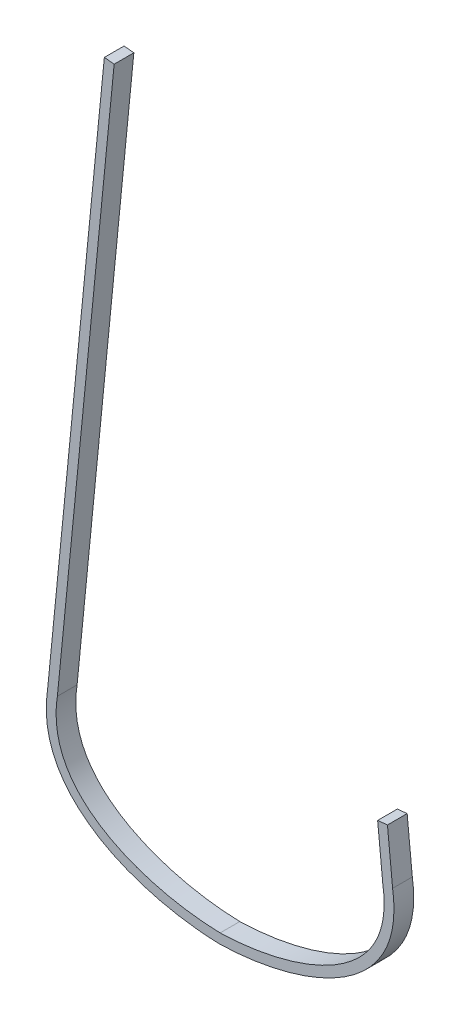
ISO-10303-21;
HEADER;
FILE_DESCRIPTION(('STEP AP214'),'2;1');
FILE_NAME('part.step','',(''),(''),'','','');
FILE_SCHEMA(('AUTOMOTIVE_DESIGN { 1 0 10303 214 1 1 1 1 }'));
ENDSEC;
DATA;
#1=APPLICATION_CONTEXT('core data for automotive mechanical design processes');
#2=APPLICATION_PROTOCOL_DEFINITION('international standard','automotive_design',2000,#1);
#3=PRODUCT_CONTEXT('',#1,'mechanical');
#4=PRODUCT('Part','Part','',(#3));
#5=PRODUCT_RELATED_PRODUCT_CATEGORY('part','',(#4));
#6=PRODUCT_DEFINITION_FORMATION('','',#4);
#7=PRODUCT_DEFINITION_CONTEXT('part definition',#1,'design');
#8=PRODUCT_DEFINITION('design','',#6,#7);
#9=PRODUCT_DEFINITION_SHAPE('','',#8);
#10=(LENGTH_UNIT() NAMED_UNIT(*) SI_UNIT(.MILLI.,.METRE.));
#11=(NAMED_UNIT(*) PLANE_ANGLE_UNIT() SI_UNIT($,.RADIAN.));
#12=(NAMED_UNIT(*) SI_UNIT($,.STERADIAN.) SOLID_ANGLE_UNIT());
#13=UNCERTAINTY_MEASURE_WITH_UNIT(LENGTH_MEASURE(1.E-05),#10,'distance_accuracy_value','');
#14=(GEOMETRIC_REPRESENTATION_CONTEXT(3) GLOBAL_UNCERTAINTY_ASSIGNED_CONTEXT((#13)) GLOBAL_UNIT_ASSIGNED_CONTEXT((#10,
#11,#12)) REPRESENTATION_CONTEXT('',''));
#15=CARTESIAN_POINT('',(0.,0.,0.));
#16=DIRECTION('',(0.,0.,1.));
#17=DIRECTION('',(1.,0.,0.));
#18=AXIS2_PLACEMENT_3D('',#15,#16,#17);
#19=CARTESIAN_POINT('',(0.,0.,19.05));
#20=CARTESIAN_POINT('',(73.6665806217367,1.74067599176395,19.05));
#21=CARTESIAN_POINT('',(181.188092360691,36.2008356091117,19.05));
#22=CARTESIAN_POINT('',(166.6875,130.175,19.05));
#23=B_SPLINE_CURVE_WITH_KNOTS('',3,(#19,#20,#21,#22),.UNSPECIFIED.,.F.,.F.,(4,4),(0.,1.),.UNSPECIFIED.);
#24=DIRECTION('',(0.,0.,-1.));
#25=VECTOR('',#24,1.);
#26=SURFACE_OF_LINEAR_EXTRUSION('',#23,#25);
#27=CARTESIAN_POINT('',(0.,0.,0.));
#28=CARTESIAN_POINT('',(73.6665806217367,1.74067599176395,0.));
#29=CARTESIAN_POINT('',(181.188092360691,36.2008356091117,0.));
#30=CARTESIAN_POINT('',(166.6875,130.175,0.));
#31=B_SPLINE_CURVE_WITH_KNOTS('',3,(#27,#28,#29,#30),.UNSPECIFIED.,.F.,.F.,(4,4),(0.,1.),.UNSPECIFIED.);
#32=CARTESIAN_POINT('',(0.,0.,0.));
#33=VERTEX_POINT('',#32);
#34=CARTESIAN_POINT('',(166.6875,130.175,0.));
#35=VERTEX_POINT('',#34);
#36=EDGE_CURVE('E145',#33,#35,#31,.T.);
#37=ORIENTED_EDGE('',*,*,#36,.T.);
#38=DIRECTION('',(0.,0.,-1.));
#39=VECTOR('',#38,1.);
#40=CARTESIAN_POINT('',(166.6875,130.175,19.05));
#41=LINE('',#40,#39);
#42=CARTESIAN_POINT('',(166.6875,130.175,19.05));
#43=VERTEX_POINT('',#42);
#44=EDGE_CURVE('E11',#43,#35,#41,.T.);
#45=ORIENTED_EDGE('',*,*,#44,.F.);
#46=CARTESIAN_POINT('',(0.,0.,19.05));
#47=VERTEX_POINT('',#46);
#48=EDGE_CURVE('E194',#47,#43,#23,.T.);
#49=ORIENTED_EDGE('',*,*,#48,.F.);
#50=DIRECTION('',(0.,0.,-1.));
#51=VECTOR('',#50,1.);
#52=CARTESIAN_POINT('',(0.,0.,19.05));
#53=LINE('',#52,#51);
#54=EDGE_CURVE('E138',#47,#33,#53,.T.);
#55=ORIENTED_EDGE('',*,*,#54,.T.);
#56=EDGE_LOOP('',(#37,#45,#49,#55));
#57=FACE_BOUND('',#56,.T.);
#58=ADVANCED_FACE('F33',(#57),#26,.F.);
#59=CARTESIAN_POINT('',(166.6875,130.175,19.05));
#60=DIRECTION('',(-0.995175000159784,-0.0981158450861751,0.));
#61=DIRECTION('',(0.0981158450861752,-0.995175000159784,0.));
#62=AXIS2_PLACEMENT_3D('',#59,#60,#61);
#63=PLANE('',#62);
#64=DIRECTION('',(-0.0981158450861751,0.995175000159784,0.));
#65=VECTOR('',#64,1.);
#66=CARTESIAN_POINT('',(166.6875,130.175,0.));
#67=LINE('',#66,#65);
#68=CARTESIAN_POINT('',(161.703215069622,180.729890008117,0.));
#69=VERTEX_POINT('',#68);
#70=EDGE_CURVE('E236',#35,#69,#67,.T.);
#71=ORIENTED_EDGE('',*,*,#70,.T.);
#72=DIRECTION('',(0.,0.,-1.));
#73=VECTOR('',#72,1.);
#74=CARTESIAN_POINT('',(161.703215069622,180.729890008117,19.05));
#75=LINE('',#74,#73);
#76=CARTESIAN_POINT('',(161.703215069622,180.729890008117,19.05));
#77=VERTEX_POINT('',#76);
#78=EDGE_CURVE('E42',#77,#69,#75,.T.);
#79=ORIENTED_EDGE('',*,*,#78,.F.);
#80=DIRECTION('',(-0.0981158450861751,0.995175000159784,0.));
#81=VECTOR('',#80,1.);
#82=CARTESIAN_POINT('',(166.6875,130.175,19.05));
#83=LINE('',#82,#81);
#84=EDGE_CURVE('E99',#43,#77,#83,.T.);
#85=ORIENTED_EDGE('',*,*,#84,.F.);
#86=ORIENTED_EDGE('',*,*,#44,.T.);
#87=EDGE_LOOP('',(#71,#79,#85,#86));
#88=FACE_BOUND('',#87,.T.);
#89=ADVANCED_FACE('F262',(#88),#63,.F.);
#90=CARTESIAN_POINT('',(152.2241731931,179.795336583671,19.05));
#91=DIRECTION('',(0.0981158450861748,-0.995175000159784,0.));
#92=DIRECTION('',(0.995175000159784,0.0981158450861748,0.));
#93=AXIS2_PLACEMENT_3D('',#90,#91,#92);
#94=PLANE('',#93);
#95=DIRECTION('',(-0.995175000159784,-0.0981158450861748,0.));
#96=VECTOR('',#95,1.);
#97=CARTESIAN_POINT('',(152.2241731931,179.795336583671,0.));
#98=LINE('',#97,#96);
#99=CARTESIAN_POINT('',(152.2241731931,179.795336583671,0.));
#100=VERTEX_POINT('',#99);
#101=EDGE_CURVE('E232',#69,#100,#98,.T.);
#102=ORIENTED_EDGE('',*,*,#101,.T.);
#103=DIRECTION('',(0.,0.,-1.));
#104=VECTOR('',#103,1.);
#105=CARTESIAN_POINT('',(152.2241731931,179.795336583671,19.05));
#106=LINE('',#105,#104);
#107=CARTESIAN_POINT('',(152.2241731931,179.795336583671,19.05));
#108=VERTEX_POINT('',#107);
#109=EDGE_CURVE('E224',#108,#100,#106,.T.);
#110=ORIENTED_EDGE('',*,*,#109,.F.);
#111=DIRECTION('',(-0.995175000159784,-0.0981158450861748,0.));
#112=VECTOR('',#111,1.);
#113=CARTESIAN_POINT('',(152.2241731931,179.795336583671,19.05));
#114=LINE('',#113,#112);
#115=EDGE_CURVE('E192',#77,#108,#114,.T.);
#116=ORIENTED_EDGE('',*,*,#115,.F.);
#117=ORIENTED_EDGE('',*,*,#78,.T.);
#118=EDGE_LOOP('',(#102,#110,#116,#117));
#119=FACE_BOUND('',#118,.T.);
#120=ADVANCED_FACE('F230',(#119),#94,.F.);
#121=CARTESIAN_POINT('',(157.23408188197,128.980548453709,19.05));
#122=DIRECTION('',(0.995175000159784,0.0981158450861752,0.));
#123=DIRECTION('',(-0.0981158450861752,0.995175000159784,0.));
#124=AXIS2_PLACEMENT_3D('',#121,#122,#123);
#125=PLANE('',#124);
#126=DIRECTION('',(0.0981158450861752,-0.995175000159784,0.));
#127=VECTOR('',#126,1.);
#128=CARTESIAN_POINT('',(157.23408188197,128.980548453709,0.));
#129=LINE('',#128,#127);
#130=CARTESIAN_POINT('',(157.23408188197,128.980548453709,0.));
#131=VERTEX_POINT('',#130);
#132=EDGE_CURVE('E238',#100,#131,#129,.T.);
#133=ORIENTED_EDGE('',*,*,#132,.T.);
#134=DIRECTION('',(0.,0.,-1.));
#135=VECTOR('',#134,1.);
#136=CARTESIAN_POINT('',(157.23408188197,128.980548453709,19.05));
#137=LINE('',#136,#135);
#138=CARTESIAN_POINT('',(157.23408188197,128.980548453709,19.05));
#139=VERTEX_POINT('',#138);
#140=EDGE_CURVE('E221',#139,#131,#137,.T.);
#141=ORIENTED_EDGE('',*,*,#140,.F.);
#142=DIRECTION('',(0.0981158450861752,-0.995175000159784,0.));
#143=VECTOR('',#142,1.);
#144=CARTESIAN_POINT('',(157.23408188197,128.980548453709,19.05));
#145=LINE('',#144,#143);
#146=EDGE_CURVE('E187',#108,#139,#145,.T.);
#147=ORIENTED_EDGE('',*,*,#146,.F.);
#148=ORIENTED_EDGE('',*,*,#109,.T.);
#149=EDGE_LOOP('',(#133,#141,#147,#148));
#150=FACE_BOUND('',#149,.T.);
#151=ADVANCED_FACE('F268',(#150),#125,.F.);
#152=CARTESIAN_POINT('',(157.23408188197,128.980548453709,19.05));
#153=CARTESIAN_POINT('',(157.261207353425,128.80475608259,19.05));
#154=CARTESIAN_POINT('',(157.316566229368,128.44670539477,19.05));
#155=CARTESIAN_POINT('',(157.415798732615,127.781927865814,19.05));
#156=CARTESIAN_POINT('',(157.584058118054,126.601085874369,19.05));
#157=CARTESIAN_POINT('',(157.881730698016,124.277278240634,19.05));
#158=CARTESIAN_POINT('',(158.206421640057,121.010360534751,19.05));
#159=CARTESIAN_POINT('',(158.437150465931,117.190167218602,19.05));
#160=CARTESIAN_POINT('',(158.540175043748,112.221426054033,19.05));
#161=CARTESIAN_POINT('',(158.296409220294,106.242287004757,19.05));
#162=CARTESIAN_POINT('',(157.442658539271,99.4182067892226,19.05));
#163=CARTESIAN_POINT('',(156.058613173129,92.923629982478,19.05));
#164=CARTESIAN_POINT('',(153.541361304269,84.6740226733845,19.05));
#165=CARTESIAN_POINT('',(149.192253507085,75.0755375544253,19.05));
#166=CARTESIAN_POINT('',(142.189146148936,64.5645369341676,19.05));
#167=CARTESIAN_POINT('',(130.643933927823,51.8035577227428,19.05));
#168=CARTESIAN_POINT('',(112.436111513656,38.1574524872599,19.05));
#169=CARTESIAN_POINT('',(90.5158541949529,27.6265370641219,19.05));
#170=CARTESIAN_POINT('',(71.6896130592172,21.0508508509878,19.05));
#171=CARTESIAN_POINT('',(57.16523288768,17.0231489798574,19.05));
#172=CARTESIAN_POINT('',(42.4774975697848,13.8758580326201,19.05));
#173=CARTESIAN_POINT('',(30.3032357230849,11.9623162671414,19.05));
#174=CARTESIAN_POINT('',(20.7254590356733,10.8404413717739,19.05));
#175=CARTESIAN_POINT('',(13.6522104162235,10.1989584372761,19.05));
#176=CARTESIAN_POINT('',(7.88003948147285,9.82720773209708,19.05));
#177=CARTESIAN_POINT('',(3.34047289736703,9.62475505591648,19.05));
#178=CARTESIAN_POINT('',(1.11761160220118,9.55519319222505,19.05));
#179=CARTESIAN_POINT('',(0.,9.52776173986118,19.05));
#180=B_SPLINE_CURVE_WITH_KNOTS('',3,(#152,#153,#154,#155,#156,#157,#158,#159,#160,#161,#162,
#163,#164,#165,#166,#167,#168,#169,#170,#171,#172,#173,#174,#175,#176,#177,#178,#179),
.UNSPECIFIED.,.F.,.F.,(4,1,1,1,1,1,1,1,1,1,1,1,1,1,1,1,1,1,1,1,1,1,1,1,1,4),
(0.00105703595463424,0.00300988454184536,0.00496273312905637,0.0088684303034785,
0.0166798246523227,0.0323026133500111,0.0479254020476996,0.063548190745388,0.0947937681407649,
0.126039345536142,0.157284922931519,0.188530500326895,0.251021655117649,0.313512809908403,
0.376003964699156,0.500986274280664,0.625968583862171,0.688459738652925,0.750950893443679,
0.813442048234432,0.875933203025186,0.907178780420563,0.93842435781594,0.969669935211317,
0.985292723909005,1.00091551260669),.UNSPECIFIED.);
#181=DIRECTION('',(0.,0.,-1.));
#182=VECTOR('',#181,1.);
#183=SURFACE_OF_LINEAR_EXTRUSION('',#180,#182);
#184=CARTESIAN_POINT('',(157.23408188197,128.980548453709,0.));
#185=CARTESIAN_POINT('',(157.261207353425,128.80475608259,0.));
#186=CARTESIAN_POINT('',(157.316566229368,128.44670539477,0.));
#187=CARTESIAN_POINT('',(157.415798732615,127.781927865814,0.));
#188=CARTESIAN_POINT('',(157.584058118054,126.601085874369,0.));
#189=CARTESIAN_POINT('',(157.881730698016,124.277278240634,0.));
#190=CARTESIAN_POINT('',(158.206421640057,121.010360534751,0.));
#191=CARTESIAN_POINT('',(158.437150465931,117.190167218602,0.));
#192=CARTESIAN_POINT('',(158.540175043748,112.221426054033,0.));
#193=CARTESIAN_POINT('',(158.296409220294,106.242287004757,0.));
#194=CARTESIAN_POINT('',(157.442658539271,99.4182067892226,0.));
#195=CARTESIAN_POINT('',(156.058613173129,92.923629982478,0.));
#196=CARTESIAN_POINT('',(153.541361304269,84.6740226733845,0.));
#197=CARTESIAN_POINT('',(149.192253507085,75.0755375544253,0.));
#198=CARTESIAN_POINT('',(142.189146148936,64.5645369341676,0.));
#199=CARTESIAN_POINT('',(130.643933927823,51.8035577227428,0.));
#200=CARTESIAN_POINT('',(112.436111513656,38.1574524872599,0.));
#201=CARTESIAN_POINT('',(90.5158541949529,27.6265370641219,0.));
#202=CARTESIAN_POINT('',(71.6896130592172,21.0508508509878,0.));
#203=CARTESIAN_POINT('',(57.16523288768,17.0231489798574,0.));
#204=CARTESIAN_POINT('',(42.4774975697848,13.8758580326201,0.));
#205=CARTESIAN_POINT('',(30.3032357230849,11.9623162671414,0.));
#206=CARTESIAN_POINT('',(20.7254590356733,10.8404413717739,0.));
#207=CARTESIAN_POINT('',(13.6522104162235,10.1989584372761,0.));
#208=CARTESIAN_POINT('',(7.88003948147285,9.82720773209708,0.));
#209=CARTESIAN_POINT('',(3.34047289736703,9.62475505591648,0.));
#210=CARTESIAN_POINT('',(1.11761160220118,9.55519319222505,0.));
#211=CARTESIAN_POINT('',(0.,9.52776173986118,0.));
#212=B_SPLINE_CURVE_WITH_KNOTS('',3,(#184,#185,#186,#187,#188,#189,#190,#191,#192,#193,#194,
#195,#196,#197,#198,#199,#200,#201,#202,#203,#204,#205,#206,#207,#208,#209,#210,#211),
.UNSPECIFIED.,.F.,.F.,(4,1,1,1,1,1,1,1,1,1,1,1,1,1,1,1,1,1,1,1,1,1,1,1,1,4),
(0.00105703595463424,0.00300988454184536,0.00496273312905637,0.0088684303034785,
0.0166798246523227,0.0323026133500111,0.0479254020476996,0.063548190745388,0.0947937681407649,
0.126039345536142,0.157284922931519,0.188530500326895,0.251021655117649,0.313512809908403,
0.376003964699156,0.500986274280664,0.625968583862171,0.688459738652925,0.750950893443679,
0.813442048234432,0.875933203025186,0.907178780420563,0.93842435781594,0.969669935211317,
0.985292723909005,1.00091551260669),.UNSPECIFIED.);
#213=CARTESIAN_POINT('',(0.,9.52776173986118,0.));
#214=VERTEX_POINT('',#213);
#215=EDGE_CURVE('E240',#131,#214,#212,.T.);
#216=ORIENTED_EDGE('',*,*,#215,.T.);
#217=DIRECTION('',(0.,0.,-1.));
#218=VECTOR('',#217,1.);
#219=CARTESIAN_POINT('',(0.,9.52776173986118,19.05));
#220=LINE('',#219,#218);
#221=CARTESIAN_POINT('',(0.,9.52776173986118,19.05));
#222=VERTEX_POINT('',#221);
#223=EDGE_CURVE('E218',#222,#214,#220,.T.);
#224=ORIENTED_EDGE('',*,*,#223,.F.);
#225=EDGE_CURVE('E179',#139,#222,#180,.T.);
#226=ORIENTED_EDGE('',*,*,#225,.F.);
#227=ORIENTED_EDGE('',*,*,#140,.T.);
#228=EDGE_LOOP('',(#216,#224,#226,#227));
#229=FACE_BOUND('',#228,.T.);
#230=ADVANCED_FACE('F171',(#229),#183,.F.);
#231=CARTESIAN_POINT('',(0.,9.52776173986118,19.05));
#232=CARTESIAN_POINT('',(-1.11761160220116,9.55519319222505,19.05));
#233=CARTESIAN_POINT('',(-3.34047289736702,9.62475505591649,19.05));
#234=CARTESIAN_POINT('',(-7.88003948147278,9.82720773209708,19.05));
#235=CARTESIAN_POINT('',(-13.6522104162235,10.1989584372761,19.05));
#236=CARTESIAN_POINT('',(-20.7254590356733,10.8404413717739,19.05));
#237=CARTESIAN_POINT('',(-30.303235723085,11.9623162671414,19.05));
#238=CARTESIAN_POINT('',(-42.4774975697847,13.8758580326201,19.05));
#239=CARTESIAN_POINT('',(-57.16523288768,17.0231489798574,19.05));
#240=CARTESIAN_POINT('',(-71.6896130592172,21.0508508509878,19.05));
#241=CARTESIAN_POINT('',(-90.5158541949529,27.626537064122,19.05));
#242=CARTESIAN_POINT('',(-112.436111513656,38.15745248726,19.05));
#243=CARTESIAN_POINT('',(-130.643933927824,51.8035577227429,19.05));
#244=CARTESIAN_POINT('',(-142.189146148936,64.5645369341677,19.05));
#245=CARTESIAN_POINT('',(-149.192253507085,75.0755375544254,19.05));
#246=CARTESIAN_POINT('',(-153.541361304269,84.6740226733847,19.05));
#247=CARTESIAN_POINT('',(-156.058613173129,92.9236299824781,19.05));
#248=CARTESIAN_POINT('',(-157.442658539271,99.4182067892228,19.05));
#249=CARTESIAN_POINT('',(-158.296409220294,106.242287004757,19.05));
#250=CARTESIAN_POINT('',(-158.540175043748,112.221426054033,19.05));
#251=CARTESIAN_POINT('',(-158.437150465931,117.190167218602,19.05));
#252=CARTESIAN_POINT('',(-158.206421640057,121.010360534751,19.05));
#253=CARTESIAN_POINT('',(-157.881730698016,124.277278240634,19.05));
#254=CARTESIAN_POINT('',(-157.584058118054,126.601085874369,19.05));
#255=CARTESIAN_POINT('',(-157.415798732615,127.781927865814,19.05));
#256=CARTESIAN_POINT('',(-157.316566229368,128.44670539477,19.05));
#257=CARTESIAN_POINT('',(-157.261207353425,128.80475608259,19.05));
#258=CARTESIAN_POINT('',(-157.23408188197,128.980548453709,19.05));
#259=B_SPLINE_CURVE_WITH_KNOTS('',3,(#231,#232,#233,#234,#235,#236,#237,#238,#239,#240,#241,
#242,#243,#244,#245,#246,#247,#248,#249,#250,#251,#252,#253,#254,#255,#256,#257,#258),
.UNSPECIFIED.,.F.,.F.,(4,1,1,1,1,1,1,1,1,1,1,1,1,1,1,1,1,1,1,1,1,1,1,1,1,4),
(0.00105703595463399,0.0166798246523224,0.0323026133500109,0.0635481907453878,
0.0947937681407647,0.126039345536142,0.188530500326895,0.251021655117649,0.313512809908403,
0.376003964699157,0.500986274280664,0.625968583862172,0.688459738652926,0.750950893443679,
0.813442048234433,0.84468762562981,0.875933203025187,0.907178780420564,0.938424357815941,
0.954047146513629,0.969669935211318,0.985292723909006,0.99310411825785,0.997009815432272,
0.998962664019483,1.00091551260669),.UNSPECIFIED.);
#260=DIRECTION('',(0.,0.,-1.));
#261=VECTOR('',#260,1.);
#262=SURFACE_OF_LINEAR_EXTRUSION('',#259,#261);
#263=CARTESIAN_POINT('',(0.,9.52776173986118,0.));
#264=CARTESIAN_POINT('',(-1.11761160220116,9.55519319222505,0.));
#265=CARTESIAN_POINT('',(-3.34047289736702,9.62475505591649,0.));
#266=CARTESIAN_POINT('',(-7.88003948147278,9.82720773209708,0.));
#267=CARTESIAN_POINT('',(-13.6522104162235,10.1989584372761,0.));
#268=CARTESIAN_POINT('',(-20.7254590356733,10.8404413717739,0.));
#269=CARTESIAN_POINT('',(-30.303235723085,11.9623162671414,0.));
#270=CARTESIAN_POINT('',(-42.4774975697847,13.8758580326201,0.));
#271=CARTESIAN_POINT('',(-57.16523288768,17.0231489798574,0.));
#272=CARTESIAN_POINT('',(-71.6896130592172,21.0508508509878,0.));
#273=CARTESIAN_POINT('',(-90.5158541949529,27.626537064122,0.));
#274=CARTESIAN_POINT('',(-112.436111513656,38.15745248726,0.));
#275=CARTESIAN_POINT('',(-130.643933927824,51.8035577227429,0.));
#276=CARTESIAN_POINT('',(-142.189146148936,64.5645369341677,0.));
#277=CARTESIAN_POINT('',(-149.192253507085,75.0755375544254,0.));
#278=CARTESIAN_POINT('',(-153.541361304269,84.6740226733847,0.));
#279=CARTESIAN_POINT('',(-156.058613173129,92.9236299824781,0.));
#280=CARTESIAN_POINT('',(-157.442658539271,99.4182067892228,0.));
#281=CARTESIAN_POINT('',(-158.296409220294,106.242287004757,0.));
#282=CARTESIAN_POINT('',(-158.540175043748,112.221426054033,0.));
#283=CARTESIAN_POINT('',(-158.437150465931,117.190167218602,0.));
#284=CARTESIAN_POINT('',(-158.206421640057,121.010360534751,0.));
#285=CARTESIAN_POINT('',(-157.881730698016,124.277278240634,0.));
#286=CARTESIAN_POINT('',(-157.584058118054,126.601085874369,0.));
#287=CARTESIAN_POINT('',(-157.415798732615,127.781927865814,0.));
#288=CARTESIAN_POINT('',(-157.316566229368,128.44670539477,0.));
#289=CARTESIAN_POINT('',(-157.261207353425,128.80475608259,0.));
#290=CARTESIAN_POINT('',(-157.23408188197,128.980548453709,0.));
#291=B_SPLINE_CURVE_WITH_KNOTS('',3,(#263,#264,#265,#266,#267,#268,#269,#270,#271,#272,#273,
#274,#275,#276,#277,#278,#279,#280,#281,#282,#283,#284,#285,#286,#287,#288,#289,#290),
.UNSPECIFIED.,.F.,.F.,(4,1,1,1,1,1,1,1,1,1,1,1,1,1,1,1,1,1,1,1,1,1,1,1,1,4),
(0.00105703595463399,0.0166798246523224,0.0323026133500109,0.0635481907453878,
0.0947937681407647,0.126039345536142,0.188530500326895,0.251021655117649,0.313512809908403,
0.376003964699157,0.500986274280664,0.625968583862172,0.688459738652926,0.750950893443679,
0.813442048234433,0.84468762562981,0.875933203025187,0.907178780420564,0.938424357815941,
0.954047146513629,0.969669935211318,0.985292723909006,0.99310411825785,0.997009815432272,
0.998962664019483,1.00091551260669),.UNSPECIFIED.);
#292=CARTESIAN_POINT('',(-157.23408188197,128.980548453709,0.));
#293=VERTEX_POINT('',#292);
#294=EDGE_CURVE('E246',#214,#293,#291,.T.);
#295=ORIENTED_EDGE('',*,*,#294,.T.);
#296=DIRECTION('',(0.,0.,-1.));
#297=VECTOR('',#296,1.);
#298=CARTESIAN_POINT('',(-157.23408188197,128.980548453709,19.05));
#299=LINE('',#298,#297);
#300=CARTESIAN_POINT('',(-157.23408188197,128.980548453709,19.05));
#301=VERTEX_POINT('',#300);
#302=EDGE_CURVE('E215',#301,#293,#299,.T.);
#303=ORIENTED_EDGE('',*,*,#302,.F.);
#304=EDGE_CURVE('E175',#222,#301,#259,.T.);
#305=ORIENTED_EDGE('',*,*,#304,.F.);
#306=ORIENTED_EDGE('',*,*,#223,.T.);
#307=EDGE_LOOP('',(#295,#303,#305,#306));
#308=FACE_BOUND('',#307,.T.);
#309=ADVANCED_FACE('F166',(#308),#262,.F.);
#310=CARTESIAN_POINT('',(-157.23408188197,128.980548453709,19.05));
#311=DIRECTION('',(-0.995175000159784,0.0981158450861758,0.));
#312=DIRECTION('',(-0.0981158450861758,-0.995175000159784,0.));
#313=AXIS2_PLACEMENT_3D('',#310,#311,#312);
#314=PLANE('',#313);
#315=DIRECTION('',(0.0981158450861758,0.995175000159784,0.));
#316=VECTOR('',#315,1.);
#317=CARTESIAN_POINT('',(-157.23408188197,128.980548453709,0.));
#318=LINE('',#317,#316);
#319=CARTESIAN_POINT('',(-102.381323889323,685.344236664841,0.));
#320=VERTEX_POINT('',#319);
#321=EDGE_CURVE('E253',#293,#320,#318,.T.);
#322=ORIENTED_EDGE('',*,*,#321,.T.);
#323=DIRECTION('',(0.,0.,-1.));
#324=VECTOR('',#323,1.);
#325=CARTESIAN_POINT('',(-102.381323889323,685.344236664841,19.05));
#326=LINE('',#325,#324);
#327=CARTESIAN_POINT('',(-102.381323889323,685.344236664841,19.05));
#328=VERTEX_POINT('',#327);
#329=EDGE_CURVE('E133',#328,#320,#326,.T.);
#330=ORIENTED_EDGE('',*,*,#329,.F.);
#331=DIRECTION('',(0.0981158450861758,0.995175000159784,0.));
#332=VECTOR('',#331,1.);
#333=CARTESIAN_POINT('',(-157.23408188197,128.980548453709,19.05));
#334=LINE('',#333,#332);
#335=EDGE_CURVE('E124',#301,#328,#334,.T.);
#336=ORIENTED_EDGE('',*,*,#335,.F.);
#337=ORIENTED_EDGE('',*,*,#302,.T.);
#338=EDGE_LOOP('',(#322,#330,#336,#337));
#339=FACE_BOUND('',#338,.T.);
#340=ADVANCED_FACE('F163',(#339),#314,.F.);
#341=CARTESIAN_POINT('',(-111.860365765845,686.278790089287,19.05));
#342=DIRECTION('',(-0.0981158450861748,-0.995175000159784,0.));
#343=DIRECTION('',(0.995175000159784,-0.0981158450861748,0.));
#344=AXIS2_PLACEMENT_3D('',#341,#342,#343);
#345=PLANE('',#344);
#346=DIRECTION('',(-0.995175000159784,0.0981158450861748,0.));
#347=VECTOR('',#346,1.);
#348=CARTESIAN_POINT('',(-111.860365765845,686.278790089287,0.));
#349=LINE('',#348,#347);
#350=CARTESIAN_POINT('',(-111.860365765845,686.278790089287,0.));
#351=VERTEX_POINT('',#350);
#352=EDGE_CURVE('E132',#320,#351,#349,.T.);
#353=ORIENTED_EDGE('',*,*,#352,.T.);
#354=DIRECTION('',(0.,0.,-1.));
#355=VECTOR('',#354,1.);
#356=CARTESIAN_POINT('',(-111.860365765845,686.278790089287,19.05));
#357=LINE('',#356,#355);
#358=CARTESIAN_POINT('',(-111.860365765845,686.278790089287,19.05));
#359=VERTEX_POINT('',#358);
#360=EDGE_CURVE('E129',#359,#351,#357,.T.);
#361=ORIENTED_EDGE('',*,*,#360,.F.);
#362=DIRECTION('',(-0.995175000159784,0.0981158450861748,0.));
#363=VECTOR('',#362,1.);
#364=CARTESIAN_POINT('',(-111.860365765845,686.278790089287,19.05));
#365=LINE('',#364,#363);
#366=EDGE_CURVE('E118',#328,#359,#365,.T.);
#367=ORIENTED_EDGE('',*,*,#366,.F.);
#368=ORIENTED_EDGE('',*,*,#329,.T.);
#369=EDGE_LOOP('',(#353,#361,#367,#368));
#370=FACE_BOUND('',#369,.T.);
#371=ADVANCED_FACE('F130',(#370),#345,.F.);
#372=CARTESIAN_POINT('',(-166.6875,130.175,19.05));
#373=DIRECTION('',(0.995175000159784,-0.0981158450861758,0.));
#374=DIRECTION('',(0.0981158450861759,0.995175000159784,0.));
#375=AXIS2_PLACEMENT_3D('',#372,#373,#374);
#376=PLANE('',#375);
#377=DIRECTION('',(-0.0981158450861758,-0.995175000159784,0.));
#378=VECTOR('',#377,1.);
#379=CARTESIAN_POINT('',(-166.6875,130.175,0.));
#380=LINE('',#379,#378);
#381=CARTESIAN_POINT('',(-166.6875,130.175,0.));
#382=VERTEX_POINT('',#381);
#383=EDGE_CURVE('E85',#351,#382,#380,.T.);
#384=ORIENTED_EDGE('',*,*,#383,.T.);
#385=DIRECTION('',(0.,0.,-1.));
#386=VECTOR('',#385,1.);
#387=CARTESIAN_POINT('',(-166.6875,130.175,19.05));
#388=LINE('',#387,#386);
#389=CARTESIAN_POINT('',(-166.6875,130.175,19.05));
#390=VERTEX_POINT('',#389);
#391=EDGE_CURVE('E134',#390,#382,#388,.T.);
#392=ORIENTED_EDGE('',*,*,#391,.F.);
#393=DIRECTION('',(-0.0981158450861758,-0.995175000159784,0.));
#394=VECTOR('',#393,1.);
#395=CARTESIAN_POINT('',(-166.6875,130.175,19.05));
#396=LINE('',#395,#394);
#397=EDGE_CURVE('E122',#359,#390,#396,.T.);
#398=ORIENTED_EDGE('',*,*,#397,.F.);
#399=ORIENTED_EDGE('',*,*,#360,.T.);
#400=EDGE_LOOP('',(#384,#392,#398,#399));
#401=FACE_BOUND('',#400,.T.);
#402=ADVANCED_FACE('F136',(#401),#376,.F.);
#403=CARTESIAN_POINT('',(-166.6875,130.175,19.05));
#404=CARTESIAN_POINT('',(-181.188092360691,36.2008356091117,19.05));
#405=CARTESIAN_POINT('',(-73.6665806217367,1.74067599176395,19.05));
#406=CARTESIAN_POINT('',(0.,0.,19.05));
#407=B_SPLINE_CURVE_WITH_KNOTS('',3,(#403,#404,#405,#406),.UNSPECIFIED.,.F.,.F.,(4,4),(0.,1.),.UNSPECIFIED.);
#408=DIRECTION('',(0.,0.,-1.));
#409=VECTOR('',#408,1.);
#410=SURFACE_OF_LINEAR_EXTRUSION('',#407,#409);
#411=CARTESIAN_POINT('',(-166.6875,130.175,0.));
#412=CARTESIAN_POINT('',(-181.188092360691,36.2008356091117,0.));
#413=CARTESIAN_POINT('',(-73.6665806217367,1.74067599176395,0.));
#414=CARTESIAN_POINT('',(0.,0.,0.));
#415=B_SPLINE_CURVE_WITH_KNOTS('',3,(#411,#412,#413,#414),.UNSPECIFIED.,.F.,.F.,(4,4),(0.,1.),.UNSPECIFIED.);
#416=EDGE_CURVE('E91',#382,#33,#415,.T.);
#417=ORIENTED_EDGE('',*,*,#416,.T.);
#418=ORIENTED_EDGE('',*,*,#54,.F.);
#419=EDGE_CURVE('E50',#390,#47,#407,.T.);
#420=ORIENTED_EDGE('',*,*,#419,.F.);
#421=ORIENTED_EDGE('',*,*,#391,.T.);
#422=EDGE_LOOP('',(#417,#418,#420,#421));
#423=FACE_BOUND('',#422,.T.);
#424=ADVANCED_FACE('F153',(#423),#410,.F.);
#425=CARTESIAN_POINT('',(116.406439868411,30.4999418503284,19.05));
#426=DIRECTION('',(0.,0.,-1.));
#427=DIRECTION('',(-1.,0.,0.));
#428=AXIS2_PLACEMENT_3D('',#425,#426,#427);
#429=PLANE('',#428);
#430=ORIENTED_EDGE('',*,*,#48,.T.);
#431=ORIENTED_EDGE('',*,*,#84,.T.);
#432=ORIENTED_EDGE('',*,*,#115,.T.);
#433=ORIENTED_EDGE('',*,*,#146,.T.);
#434=ORIENTED_EDGE('',*,*,#225,.T.);
#435=ORIENTED_EDGE('',*,*,#304,.T.);
#436=ORIENTED_EDGE('',*,*,#335,.T.);
#437=ORIENTED_EDGE('',*,*,#366,.T.);
#438=ORIENTED_EDGE('',*,*,#397,.T.);
#439=ORIENTED_EDGE('',*,*,#419,.T.);
#440=EDGE_LOOP('',(#430,#431,#432,#433,#434,#435,#436,#437,#438,#439));
#441=FACE_BOUND('',#440,.T.);
#442=ADVANCED_FACE('F120',(#441),#429,.F.);
#443=CARTESIAN_POINT('',(116.406439868411,30.4999418503284,0.));
#444=DIRECTION('',(0.,0.,-1.));
#445=DIRECTION('',(-1.,0.,0.));
#446=AXIS2_PLACEMENT_3D('',#443,#444,#445);
#447=PLANE('',#446);
#448=ORIENTED_EDGE('',*,*,#36,.F.);
#449=ORIENTED_EDGE('',*,*,#416,.F.);
#450=ORIENTED_EDGE('',*,*,#383,.F.);
#451=ORIENTED_EDGE('',*,*,#352,.F.);
#452=ORIENTED_EDGE('',*,*,#321,.F.);
#453=ORIENTED_EDGE('',*,*,#294,.F.);
#454=ORIENTED_EDGE('',*,*,#215,.F.);
#455=ORIENTED_EDGE('',*,*,#132,.F.);
#456=ORIENTED_EDGE('',*,*,#101,.F.);
#457=ORIENTED_EDGE('',*,*,#70,.F.);
#458=EDGE_LOOP('',(#448,#449,#450,#451,#452,#453,#454,#455,#456,#457));
#459=FACE_BOUND('',#458,.T.);
#460=ADVANCED_FACE('F157',(#459),#447,.T.);
#461=CLOSED_SHELL('',(#58,#89,#120,#151,#230,#309,#340,#371,#402,#424,#442,#460));
#462=MANIFOLD_SOLID_BREP('B2',#461);
#463=ADVANCED_BREP_SHAPE_REPRESENTATION('',(#18,#462),#14);
#464=SHAPE_DEFINITION_REPRESENTATION(#9,#463);
ENDSEC;
END-ISO-10303-21;
